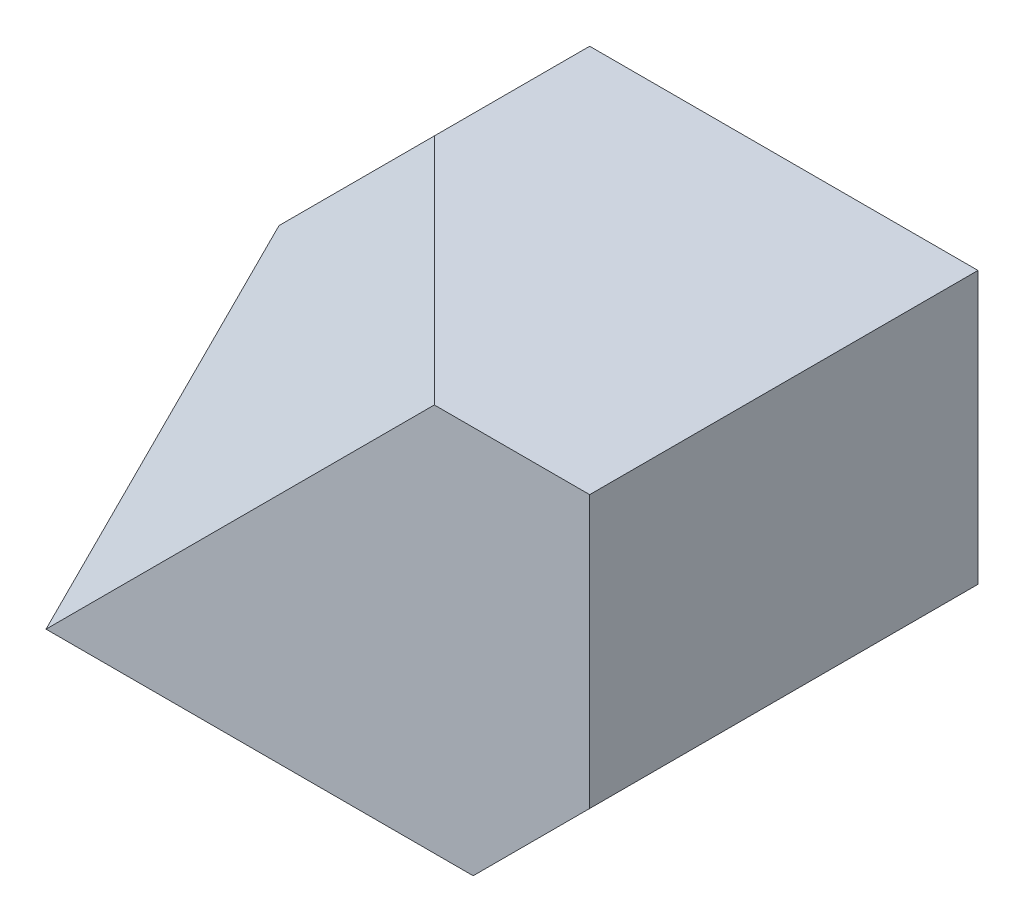
ISO-10303-21;
HEADER;
FILE_DESCRIPTION(('STEP AP214'),'2;1');
FILE_NAME('part.step','',(''),(''),'','','');
FILE_SCHEMA(('AUTOMOTIVE_DESIGN { 1 0 10303 214 1 1 1 1 }'));
ENDSEC;
DATA;
#1=APPLICATION_CONTEXT('core data for automotive mechanical design processes');
#2=APPLICATION_PROTOCOL_DEFINITION('international standard','automotive_design',2000,#1);
#3=PRODUCT_CONTEXT('',#1,'mechanical');
#4=PRODUCT('Part','Part','',(#3));
#5=PRODUCT_RELATED_PRODUCT_CATEGORY('part','',(#4));
#6=PRODUCT_DEFINITION_FORMATION('','',#4);
#7=PRODUCT_DEFINITION_CONTEXT('part definition',#1,'design');
#8=PRODUCT_DEFINITION('design','',#6,#7);
#9=PRODUCT_DEFINITION_SHAPE('','',#8);
#10=(LENGTH_UNIT() NAMED_UNIT(*) SI_UNIT(.MILLI.,.METRE.));
#11=(NAMED_UNIT(*) PLANE_ANGLE_UNIT() SI_UNIT($,.RADIAN.));
#12=(NAMED_UNIT(*) SI_UNIT($,.STERADIAN.) SOLID_ANGLE_UNIT());
#13=UNCERTAINTY_MEASURE_WITH_UNIT(LENGTH_MEASURE(1.E-05),#10,'distance_accuracy_value','');
#14=(GEOMETRIC_REPRESENTATION_CONTEXT(3) GLOBAL_UNCERTAINTY_ASSIGNED_CONTEXT((#13)) GLOBAL_UNIT_ASSIGNED_CONTEXT((#10,
#11,#12)) REPRESENTATION_CONTEXT('',''));
#15=CARTESIAN_POINT('',(0.,0.,0.));
#16=DIRECTION('',(0.,0.,1.));
#17=DIRECTION('',(1.,0.,0.));
#18=AXIS2_PLACEMENT_3D('',#15,#16,#17);
#19=CARTESIAN_POINT('',(0.,15.,15.));
#20=DIRECTION('',(0.,-1.,0.));
#21=DIRECTION('',(0.,0.,-1.));
#22=AXIS2_PLACEMENT_3D('',#19,#20,#21);
#23=PLANE('',#22);
#24=DIRECTION('',(0.,0.,-1.));
#25=VECTOR('',#24,1.);
#26=CARTESIAN_POINT('',(70.,15.,15.));
#27=LINE('',#26,#25);
#28=CARTESIAN_POINT('',(70.,15.,15.));
#29=VERTEX_POINT('',#28);
#30=CARTESIAN_POINT('',(70.,15.,0.));
#31=VERTEX_POINT('',#30);
#32=EDGE_CURVE('E164',#29,#31,#27,.T.);
#33=ORIENTED_EDGE('',*,*,#32,.F.);
#34=DIRECTION('',(0.707106781186548,0.,0.707106781186547));
#35=VECTOR('',#34,1.);
#36=CARTESIAN_POINT('',(70.,15.,15.));
#37=LINE('',#36,#35);
#38=CARTESIAN_POINT('',(55.,15.,0.));
#39=VERTEX_POINT('',#38);
#40=EDGE_CURVE('E157',#39,#29,#37,.T.);
#41=ORIENTED_EDGE('',*,*,#40,.F.);
#42=DIRECTION('',(-1.,0.,0.));
#43=VECTOR('',#42,1.);
#44=CARTESIAN_POINT('',(0.,15.,0.));
#45=LINE('',#44,#43);
#46=EDGE_CURVE('E160',#31,#39,#45,.T.);
#47=ORIENTED_EDGE('',*,*,#46,.F.);
#48=EDGE_LOOP('',(#33,#41,#47));
#49=FACE_BOUND('',#48,.T.);
#50=ADVANCED_FACE('F33',(#49),#23,.T.);
#51=CARTESIAN_POINT('',(55.,0.,15.));
#52=DIRECTION('',(-1.,0.,0.));
#53=DIRECTION('',(0.,0.,1.));
#54=AXIS2_PLACEMENT_3D('',#51,#52,#53);
#55=PLANE('',#54);
#56=DIRECTION('',(0.,0.707106781186547,-0.707106781186548));
#57=VECTOR('',#56,1.);
#58=CARTESIAN_POINT('',(55.,15.,0.));
#59=LINE('',#58,#57);
#60=CARTESIAN_POINT('',(55.,0.,15.));
#61=VERTEX_POINT('',#60);
#62=EDGE_CURVE('E154',#61,#39,#59,.T.);
#63=ORIENTED_EDGE('',*,*,#62,.F.);
#64=DIRECTION('',(0.,0.,-1.));
#65=VECTOR('',#64,1.);
#66=CARTESIAN_POINT('',(55.,0.,15.));
#67=LINE('',#66,#65);
#68=CARTESIAN_POINT('',(55.,0.,0.));
#69=VERTEX_POINT('',#68);
#70=EDGE_CURVE('E170',#61,#69,#67,.T.);
#71=ORIENTED_EDGE('',*,*,#70,.T.);
#72=DIRECTION('',(0.,1.,0.));
#73=VECTOR('',#72,1.);
#74=CARTESIAN_POINT('',(55.,0.,0.));
#75=LINE('',#74,#73);
#76=EDGE_CURVE('E165',#69,#39,#75,.T.);
#77=ORIENTED_EDGE('',*,*,#76,.T.);
#78=EDGE_LOOP('',(#63,#71,#77));
#79=FACE_BOUND('',#78,.T.);
#80=ADVANCED_FACE('F217',(#79),#55,.F.);
#81=CARTESIAN_POINT('',(55.,0.,50.));
#82=DIRECTION('',(-0.707106781186547,0.707106781186548,0.));
#83=DIRECTION('',(-0.707106781186548,-0.707106781186547,0.));
#84=AXIS2_PLACEMENT_3D('',#81,#82,#83);
#85=PLANE('',#84);
#86=DIRECTION('',(-0.707106781186548,-0.707106781186547,0.));
#87=VECTOR('',#86,1.);
#88=CARTESIAN_POINT('',(27.5,-27.5,15.));
#89=LINE('',#88,#87);
#90=EDGE_CURVE('E161',#29,#61,#89,.T.);
#91=ORIENTED_EDGE('',*,*,#90,.F.);
#92=DIRECTION('',(0.,0.,-1.));
#93=VECTOR('',#92,1.);
#94=CARTESIAN_POINT('',(70.,15.,50.));
#95=LINE('',#94,#93);
#96=CARTESIAN_POINT('',(70.,15.,50.));
#97=VERTEX_POINT('',#96);
#98=EDGE_CURVE('E42',#97,#29,#95,.T.);
#99=ORIENTED_EDGE('',*,*,#98,.F.);
#100=DIRECTION('',(0.707106781186548,0.707106781186547,0.));
#101=VECTOR('',#100,1.);
#102=CARTESIAN_POINT('',(55.,0.,50.));
#103=LINE('',#102,#101);
#104=CARTESIAN_POINT('',(55.,0.,50.));
#105=VERTEX_POINT('',#104);
#106=EDGE_CURVE('E182',#105,#97,#103,.T.);
#107=ORIENTED_EDGE('',*,*,#106,.F.);
#108=DIRECTION('',(0.,0.,-1.));
#109=VECTOR('',#108,1.);
#110=CARTESIAN_POINT('',(55.,0.,50.));
#111=LINE('',#110,#109);
#112=EDGE_CURVE('E11',#105,#61,#111,.T.);
#113=ORIENTED_EDGE('',*,*,#112,.T.);
#114=EDGE_LOOP('',(#91,#99,#107,#113));
#115=FACE_BOUND('',#114,.T.);
#116=ADVANCED_FACE('F253',(#115),#85,.F.);
#117=CARTESIAN_POINT('',(0.,0.,0.));
#118=DIRECTION('',(0.,0.,1.));
#119=DIRECTION('',(1.,0.,0.));
#120=AXIS2_PLACEMENT_3D('',#117,#118,#119);
#121=PLANE('',#120);
#122=DIRECTION('',(1.,0.,0.));
#123=VECTOR('',#122,1.);
#124=CARTESIAN_POINT('',(0.,0.,0.));
#125=LINE('',#124,#123);
#126=CARTESIAN_POINT('',(20.,0.,0.));
#127=VERTEX_POINT('',#126);
#128=EDGE_CURVE('E142',#127,#69,#125,.T.);
#129=ORIENTED_EDGE('',*,*,#128,.F.);
#130=DIRECTION('',(0.,-1.,0.));
#131=VECTOR('',#130,1.);
#132=CARTESIAN_POINT('',(20.,15.,0.));
#133=LINE('',#132,#131);
#134=CARTESIAN_POINT('',(20.,15.,0.));
#135=VERTEX_POINT('',#134);
#136=EDGE_CURVE('E125',#135,#127,#133,.T.);
#137=ORIENTED_EDGE('',*,*,#136,.F.);
#138=DIRECTION('',(1.,0.,0.));
#139=VECTOR('',#138,1.);
#140=CARTESIAN_POINT('',(20.,15.,0.));
#141=LINE('',#140,#139);
#142=CARTESIAN_POINT('',(0.,15.,0.));
#143=VERTEX_POINT('',#142);
#144=EDGE_CURVE('E132',#143,#135,#141,.T.);
#145=ORIENTED_EDGE('',*,*,#144,.F.);
#146=DIRECTION('',(0.,-1.,0.));
#147=VECTOR('',#146,1.);
#148=CARTESIAN_POINT('',(0.,0.,0.));
#149=LINE('',#148,#147);
#150=CARTESIAN_POINT('',(0.,30.,0.));
#151=VERTEX_POINT('',#150);
#152=EDGE_CURVE('E183',#151,#143,#149,.T.);
#153=ORIENTED_EDGE('',*,*,#152,.F.);
#154=DIRECTION('',(-0.707106781186548,-0.707106781186547,0.));
#155=VECTOR('',#154,1.);
#156=CARTESIAN_POINT('',(20.,50.,0.));
#157=LINE('',#156,#155);
#158=CARTESIAN_POINT('',(20.,50.,0.));
#159=VERTEX_POINT('',#158);
#160=EDGE_CURVE('E195',#159,#151,#157,.T.);
#161=ORIENTED_EDGE('',*,*,#160,.F.);
#162=DIRECTION('',(-1.,0.,0.));
#163=VECTOR('',#162,1.);
#164=CARTESIAN_POINT('',(70.,50.,0.));
#165=LINE('',#164,#163);
#166=CARTESIAN_POINT('',(70.,50.,0.));
#167=VERTEX_POINT('',#166);
#168=EDGE_CURVE('E192',#167,#159,#165,.T.);
#169=ORIENTED_EDGE('',*,*,#168,.F.);
#170=DIRECTION('',(0.,1.,0.));
#171=VECTOR('',#170,1.);
#172=CARTESIAN_POINT('',(70.,15.,0.));
#173=LINE('',#172,#171);
#174=EDGE_CURVE('E190',#31,#167,#173,.T.);
#175=ORIENTED_EDGE('',*,*,#174,.F.);
#176=ORIENTED_EDGE('',*,*,#46,.T.);
#177=ORIENTED_EDGE('',*,*,#76,.F.);
#178=EDGE_LOOP('',(#129,#137,#145,#153,#161,#169,#175,#176,#177));
#179=FACE_BOUND('',#178,.T.);
#180=ADVANCED_FACE('F140',(#179),#121,.F.);
#181=CARTESIAN_POINT('',(0.,0.,50.));
#182=DIRECTION('',(0.,1.,0.));
#183=DIRECTION('',(0.,0.,1.));
#184=AXIS2_PLACEMENT_3D('',#181,#182,#183);
#185=PLANE('',#184);
#186=DIRECTION('',(0.,0.,-1.));
#187=VECTOR('',#186,1.);
#188=CARTESIAN_POINT('',(0.,0.,50.));
#189=LINE('',#188,#187);
#190=CARTESIAN_POINT('',(0.,0.,50.));
#191=VERTEX_POINT('',#190);
#192=CARTESIAN_POINT('',(0.,0.,0.));
#193=VERTEX_POINT('',#192);
#194=EDGE_CURVE('E188',#191,#193,#189,.T.);
#195=ORIENTED_EDGE('',*,*,#194,.T.);
#196=DIRECTION('',(-0.707106781186548,0.,-0.707106781186548));
#197=VECTOR('',#196,1.);
#198=CARTESIAN_POINT('',(0.,0.,0.));
#199=LINE('',#198,#197);
#200=CARTESIAN_POINT('',(20.,0.,20.));
#201=VERTEX_POINT('',#200);
#202=EDGE_CURVE('E78',#201,#193,#199,.T.);
#203=ORIENTED_EDGE('',*,*,#202,.F.);
#204=DIRECTION('',(0.,0.,1.));
#205=VECTOR('',#204,1.);
#206=CARTESIAN_POINT('',(20.,0.,20.));
#207=LINE('',#206,#205);
#208=EDGE_CURVE('E237',#127,#201,#207,.T.);
#209=ORIENTED_EDGE('',*,*,#208,.F.);
#210=ORIENTED_EDGE('',*,*,#128,.T.);
#211=ORIENTED_EDGE('',*,*,#70,.F.);
#212=ORIENTED_EDGE('',*,*,#112,.F.);
#213=DIRECTION('',(1.,0.,0.));
#214=VECTOR('',#213,1.);
#215=CARTESIAN_POINT('',(0.,0.,50.));
#216=LINE('',#215,#214);
#217=EDGE_CURVE('E83',#191,#105,#216,.T.);
#218=ORIENTED_EDGE('',*,*,#217,.F.);
#219=EDGE_LOOP('',(#195,#203,#209,#210,#211,#212,#218));
#220=FACE_BOUND('',#219,.T.);
#221=ADVANCED_FACE('F35',(#220),#185,.F.);
#222=CARTESIAN_POINT('',(70.,15.,50.));
#223=DIRECTION('',(-1.,0.,0.));
#224=DIRECTION('',(0.,0.,1.));
#225=AXIS2_PLACEMENT_3D('',#222,#223,#224);
#226=PLANE('',#225);
#227=ORIENTED_EDGE('',*,*,#174,.T.);
#228=DIRECTION('',(0.,0.,-1.));
#229=VECTOR('',#228,1.);
#230=CARTESIAN_POINT('',(70.,50.,50.));
#231=LINE('',#230,#229);
#232=CARTESIAN_POINT('',(70.,50.,50.));
#233=VERTEX_POINT('',#232);
#234=EDGE_CURVE('E203',#233,#167,#231,.T.);
#235=ORIENTED_EDGE('',*,*,#234,.F.);
#236=DIRECTION('',(0.,1.,0.));
#237=VECTOR('',#236,1.);
#238=CARTESIAN_POINT('',(70.,15.,50.));
#239=LINE('',#238,#237);
#240=EDGE_CURVE('E50',#97,#233,#239,.T.);
#241=ORIENTED_EDGE('',*,*,#240,.F.);
#242=ORIENTED_EDGE('',*,*,#98,.T.);
#243=ORIENTED_EDGE('',*,*,#32,.T.);
#244=EDGE_LOOP('',(#227,#235,#241,#242,#243));
#245=FACE_BOUND('',#244,.T.);
#246=ADVANCED_FACE('F208',(#245),#226,.F.);
#247=CARTESIAN_POINT('',(70.,50.,50.));
#248=DIRECTION('',(0.,-1.,0.));
#249=DIRECTION('',(1.,0.,0.));
#250=AXIS2_PLACEMENT_3D('',#247,#248,#249);
#251=PLANE('',#250);
#252=DIRECTION('',(0.707106781186548,0.,0.707106781186547));
#253=VECTOR('',#252,1.);
#254=CARTESIAN_POINT('',(20.,50.,20.));
#255=LINE('',#254,#253);
#256=CARTESIAN_POINT('',(20.,50.,20.));
#257=VERTEX_POINT('',#256);
#258=CARTESIAN_POINT('',(50.,50.,50.));
#259=VERTEX_POINT('',#258);
#260=EDGE_CURVE('E149',#257,#259,#255,.T.);
#261=ORIENTED_EDGE('',*,*,#260,.T.);
#262=DIRECTION('',(-1.,0.,0.));
#263=VECTOR('',#262,1.);
#264=CARTESIAN_POINT('',(70.,50.,50.));
#265=LINE('',#264,#263);
#266=EDGE_CURVE('E186',#233,#259,#265,.T.);
#267=ORIENTED_EDGE('',*,*,#266,.F.);
#268=ORIENTED_EDGE('',*,*,#234,.T.);
#269=ORIENTED_EDGE('',*,*,#168,.T.);
#270=DIRECTION('',(0.,0.,-1.));
#271=VECTOR('',#270,1.);
#272=CARTESIAN_POINT('',(20.,50.,50.));
#273=LINE('',#272,#271);
#274=EDGE_CURVE('E201',#257,#159,#273,.T.);
#275=ORIENTED_EDGE('',*,*,#274,.F.);
#276=EDGE_LOOP('',(#261,#267,#268,#269,#275));
#277=FACE_BOUND('',#276,.T.);
#278=ADVANCED_FACE('F223',(#277),#251,.F.);
#279=CARTESIAN_POINT('',(20.,50.,50.));
#280=DIRECTION('',(0.707106781186547,-0.707106781186548,0.));
#281=DIRECTION('',(0.707106781186548,0.707106781186547,0.));
#282=AXIS2_PLACEMENT_3D('',#279,#280,#281);
#283=PLANE('',#282);
#284=DIRECTION('',(0.,0.,-1.));
#285=VECTOR('',#284,1.);
#286=CARTESIAN_POINT('',(0.,30.,50.));
#287=LINE('',#286,#285);
#288=CARTESIAN_POINT('',(0.,30.,20.));
#289=VERTEX_POINT('',#288);
#290=EDGE_CURVE('E71',#289,#151,#287,.T.);
#291=ORIENTED_EDGE('',*,*,#290,.F.);
#292=DIRECTION('',(-0.707106781186548,-0.707106781186548,0.));
#293=VECTOR('',#292,1.);
#294=CARTESIAN_POINT('',(20.,50.,20.));
#295=LINE('',#294,#293);
#296=EDGE_CURVE('E176',#257,#289,#295,.T.);
#297=ORIENTED_EDGE('',*,*,#296,.F.);
#298=ORIENTED_EDGE('',*,*,#274,.T.);
#299=ORIENTED_EDGE('',*,*,#160,.T.);
#300=EDGE_LOOP('',(#291,#297,#298,#299));
#301=FACE_BOUND('',#300,.T.);
#302=ADVANCED_FACE('F234',(#301),#283,.F.);
#303=CARTESIAN_POINT('',(0.,0.,50.));
#304=DIRECTION('',(1.,0.,0.));
#305=DIRECTION('',(0.,0.,-1.));
#306=AXIS2_PLACEMENT_3D('',#303,#304,#305);
#307=PLANE('',#306);
#308=ORIENTED_EDGE('',*,*,#152,.T.);
#309=DIRECTION('',(0.,-1.,0.));
#310=VECTOR('',#309,1.);
#311=CARTESIAN_POINT('',(0.,15.,0.));
#312=LINE('',#311,#310);
#313=EDGE_CURVE('E144',#143,#193,#312,.T.);
#314=ORIENTED_EDGE('',*,*,#313,.T.);
#315=ORIENTED_EDGE('',*,*,#194,.F.);
#316=DIRECTION('',(0.,0.707106781186547,-0.707106781186548));
#317=VECTOR('',#316,1.);
#318=CARTESIAN_POINT('',(0.,30.,20.));
#319=LINE('',#318,#317);
#320=EDGE_CURVE('E152',#191,#289,#319,.T.);
#321=ORIENTED_EDGE('',*,*,#320,.T.);
#322=ORIENTED_EDGE('',*,*,#290,.T.);
#323=EDGE_LOOP('',(#308,#314,#315,#321,#322));
#324=FACE_BOUND('',#323,.T.);
#325=ADVANCED_FACE('F232',(#324),#307,.F.);
#326=CARTESIAN_POINT('',(0.,0.,50.));
#327=DIRECTION('',(0.,0.,1.));
#328=DIRECTION('',(1.,0.,0.));
#329=AXIS2_PLACEMENT_3D('',#326,#327,#328);
#330=PLANE('',#329);
#331=ORIENTED_EDGE('',*,*,#217,.T.);
#332=ORIENTED_EDGE('',*,*,#106,.T.);
#333=ORIENTED_EDGE('',*,*,#240,.T.);
#334=ORIENTED_EDGE('',*,*,#266,.T.);
#335=DIRECTION('',(0.707106781186548,0.707106781186547,0.));
#336=VECTOR('',#335,1.);
#337=CARTESIAN_POINT('',(0.,0.,50.));
#338=LINE('',#337,#336);
#339=EDGE_CURVE('E173',#191,#259,#338,.T.);
#340=ORIENTED_EDGE('',*,*,#339,.F.);
#341=EDGE_LOOP('',(#331,#332,#333,#334,#340));
#342=FACE_BOUND('',#341,.T.);
#343=ADVANCED_FACE('F225',(#342),#330,.T.);
#344=CARTESIAN_POINT('',(13.3333333333333,-13.3333333333333,-13.3333333333333));
#345=DIRECTION('',(-0.577350269189626,0.577350269189626,0.577350269189626));
#346=DIRECTION('',(0.707106781186548,0.,0.707106781186547));
#347=AXIS2_PLACEMENT_3D('',#344,#345,#346);
#348=PLANE('',#347);
#349=ORIENTED_EDGE('',*,*,#62,.T.);
#350=ORIENTED_EDGE('',*,*,#40,.T.);
#351=ORIENTED_EDGE('',*,*,#90,.T.);
#352=EDGE_LOOP('',(#349,#350,#351));
#353=FACE_BOUND('',#352,.T.);
#354=ADVANCED_FACE('F213',(#353),#348,.F.);
#355=CARTESIAN_POINT('',(-16.6666666666667,16.6666666666667,16.6666666666667));
#356=DIRECTION('',(0.577350269189626,-0.577350269189626,-0.577350269189625));
#357=DIRECTION('',(0.707106781186548,0.707106781186547,0.));
#358=AXIS2_PLACEMENT_3D('',#355,#356,#357);
#359=PLANE('',#358);
#360=ORIENTED_EDGE('',*,*,#296,.T.);
#361=ORIENTED_EDGE('',*,*,#320,.F.);
#362=ORIENTED_EDGE('',*,*,#339,.T.);
#363=ORIENTED_EDGE('',*,*,#260,.F.);
#364=EDGE_LOOP('',(#360,#361,#362,#363));
#365=FACE_BOUND('',#364,.T.);
#366=ADVANCED_FACE('F230',(#365),#359,.F.);
#367=CARTESIAN_POINT('',(0.,15.,0.));
#368=DIRECTION('',(-0.707106781186547,0.,0.707106781186547));
#369=DIRECTION('',(0.707106781186548,0.,0.707106781186548));
#370=AXIS2_PLACEMENT_3D('',#367,#368,#369);
#371=PLANE('',#370);
#372=ORIENTED_EDGE('',*,*,#202,.T.);
#373=ORIENTED_EDGE('',*,*,#313,.F.);
#374=DIRECTION('',(-0.707106781186548,0.,-0.707106781186548));
#375=VECTOR('',#374,1.);
#376=CARTESIAN_POINT('',(0.,15.,0.));
#377=LINE('',#376,#375);
#378=CARTESIAN_POINT('',(20.,15.,20.));
#379=VERTEX_POINT('',#378);
#380=EDGE_CURVE('E131',#379,#143,#377,.T.);
#381=ORIENTED_EDGE('',*,*,#380,.F.);
#382=DIRECTION('',(0.,-1.,0.));
#383=VECTOR('',#382,1.);
#384=CARTESIAN_POINT('',(20.,15.,20.));
#385=LINE('',#384,#383);
#386=EDGE_CURVE('E127',#379,#201,#385,.T.);
#387=ORIENTED_EDGE('',*,*,#386,.T.);
#388=EDGE_LOOP('',(#372,#373,#381,#387));
#389=FACE_BOUND('',#388,.T.);
#390=ADVANCED_FACE('F238',(#389),#371,.F.);
#391=CARTESIAN_POINT('',(20.,15.,20.));
#392=DIRECTION('',(1.,0.,0.));
#393=DIRECTION('',(0.,0.,-1.));
#394=AXIS2_PLACEMENT_3D('',#391,#392,#393);
#395=PLANE('',#394);
#396=ORIENTED_EDGE('',*,*,#208,.T.);
#397=ORIENTED_EDGE('',*,*,#386,.F.);
#398=DIRECTION('',(0.,0.,1.));
#399=VECTOR('',#398,1.);
#400=CARTESIAN_POINT('',(20.,15.,20.));
#401=LINE('',#400,#399);
#402=EDGE_CURVE('E120',#135,#379,#401,.T.);
#403=ORIENTED_EDGE('',*,*,#402,.F.);
#404=ORIENTED_EDGE('',*,*,#136,.T.);
#405=EDGE_LOOP('',(#396,#397,#403,#404));
#406=FACE_BOUND('',#405,.T.);
#407=ADVANCED_FACE('F123',(#406),#395,.F.);
#408=CARTESIAN_POINT('',(0.,15.,0.));
#409=DIRECTION('',(0.,-1.,0.));
#410=DIRECTION('',(0.,0.,-1.));
#411=AXIS2_PLACEMENT_3D('',#408,#409,#410);
#412=PLANE('',#411);
#413=ORIENTED_EDGE('',*,*,#144,.T.);
#414=ORIENTED_EDGE('',*,*,#402,.T.);
#415=ORIENTED_EDGE('',*,*,#380,.T.);
#416=EDGE_LOOP('',(#413,#414,#415));
#417=FACE_BOUND('',#416,.T.);
#418=ADVANCED_FACE('F135',(#417),#412,.T.);
#419=CLOSED_SHELL('',(#50,#80,#116,#180,#221,#246,#278,#302,#325,#343,#354,#366,#390,#407,#418));
#420=MANIFOLD_SOLID_BREP('B2',#419);
#421=ADVANCED_BREP_SHAPE_REPRESENTATION('',(#18,#420),#14);
#422=SHAPE_DEFINITION_REPRESENTATION(#9,#421);
ENDSEC;
END-ISO-10303-21;
